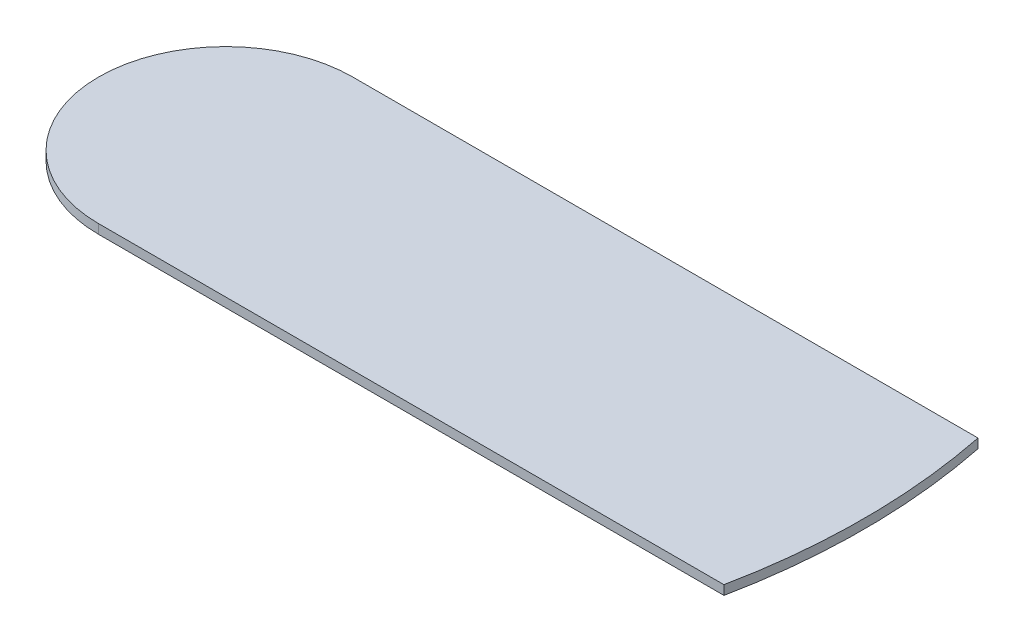
ISO-10303-21;
HEADER;
FILE_DESCRIPTION(('STEP AP214'),'2;1');
FILE_NAME('part.step','',(''),(''),'','','');
FILE_SCHEMA(('AUTOMOTIVE_DESIGN { 1 0 10303 214 1 1 1 1 }'));
ENDSEC;
DATA;
#1=APPLICATION_CONTEXT('core data for automotive mechanical design processes');
#2=APPLICATION_PROTOCOL_DEFINITION('international standard','automotive_design',2000,#1);
#3=PRODUCT_CONTEXT('',#1,'mechanical');
#4=PRODUCT('Part','Part','',(#3));
#5=PRODUCT_RELATED_PRODUCT_CATEGORY('part','',(#4));
#6=PRODUCT_DEFINITION_FORMATION('','',#4);
#7=PRODUCT_DEFINITION_CONTEXT('part definition',#1,'design');
#8=PRODUCT_DEFINITION('design','',#6,#7);
#9=PRODUCT_DEFINITION_SHAPE('','',#8);
#10=(LENGTH_UNIT() NAMED_UNIT(*) SI_UNIT(.MILLI.,.METRE.));
#11=(NAMED_UNIT(*) PLANE_ANGLE_UNIT() SI_UNIT($,.RADIAN.));
#12=(NAMED_UNIT(*) SI_UNIT($,.STERADIAN.) SOLID_ANGLE_UNIT());
#13=UNCERTAINTY_MEASURE_WITH_UNIT(LENGTH_MEASURE(1.E-05),#10,'distance_accuracy_value','');
#14=(GEOMETRIC_REPRESENTATION_CONTEXT(3) GLOBAL_UNCERTAINTY_ASSIGNED_CONTEXT((#13)) GLOBAL_UNIT_ASSIGNED_CONTEXT((#10,
#11,#12)) REPRESENTATION_CONTEXT('',''));
#15=CARTESIAN_POINT('',(0.,0.,0.));
#16=DIRECTION('',(0.,0.,1.));
#17=DIRECTION('',(1.,0.,0.));
#18=AXIS2_PLACEMENT_3D('',#15,#16,#17);
#19=CARTESIAN_POINT('',(0.,1.95,0.));
#20=DIRECTION('',(0.,-1.,0.));
#21=DIRECTION('',(0.,0.,-1.));
#22=AXIS2_PLACEMENT_3D('',#19,#20,#21);
#23=CYLINDRICAL_SURFACE('',#22,26.575);
#24=CARTESIAN_POINT('',(0.,0.,0.));
#25=DIRECTION('',(0.,1.,0.));
#26=DIRECTION('',(0.,0.,1.));
#27=AXIS2_PLACEMENT_3D('',#24,#25,#26);
#28=CIRCLE('',#27,26.575);
#29=CARTESIAN_POINT('',(0.,0.,-26.575));
#30=VERTEX_POINT('',#29);
#31=CARTESIAN_POINT('',(0.,0.,26.575));
#32=VERTEX_POINT('',#31);
#33=EDGE_CURVE('E95',#30,#32,#28,.T.);
#34=ORIENTED_EDGE('',*,*,#33,.T.);
#35=DIRECTION('',(0.,-1.,0.));
#36=VECTOR('',#35,1.);
#37=CARTESIAN_POINT('',(0.,1.95,26.575));
#38=LINE('',#37,#36);
#39=CARTESIAN_POINT('',(0.,1.95,26.575));
#40=VERTEX_POINT('',#39);
#41=EDGE_CURVE('E11',#40,#32,#38,.T.);
#42=ORIENTED_EDGE('',*,*,#41,.F.);
#43=CARTESIAN_POINT('',(0.,1.95,0.));
#44=DIRECTION('',(0.,1.,0.));
#45=DIRECTION('',(0.,0.,1.));
#46=AXIS2_PLACEMENT_3D('',#43,#44,#45);
#47=CIRCLE('',#46,26.575);
#48=CARTESIAN_POINT('',(0.,1.95,-26.575));
#49=VERTEX_POINT('',#48);
#50=EDGE_CURVE('E81',#49,#40,#47,.T.);
#51=ORIENTED_EDGE('',*,*,#50,.F.);
#52=DIRECTION('',(0.,-1.,0.));
#53=VECTOR('',#52,1.);
#54=CARTESIAN_POINT('',(0.,1.95,-26.575));
#55=LINE('',#54,#53);
#56=EDGE_CURVE('E48',#49,#30,#55,.T.);
#57=ORIENTED_EDGE('',*,*,#56,.T.);
#58=EDGE_LOOP('',(#34,#42,#51,#57));
#59=FACE_BOUND('',#58,.T.);
#60=ADVANCED_FACE('F32',(#59),#23,.T.);
#61=CARTESIAN_POINT('',(0.,1.95,26.575));
#62=DIRECTION('',(0.,0.,-1.));
#63=DIRECTION('',(-1.,0.,0.));
#64=AXIS2_PLACEMENT_3D('',#61,#62,#63);
#65=PLANE('',#64);
#66=DIRECTION('',(1.,0.,0.));
#67=VECTOR('',#66,1.);
#68=CARTESIAN_POINT('',(0.,0.,26.575));
#69=LINE('',#68,#67);
#70=CARTESIAN_POINT('',(130.828205578919,0.,26.575));
#71=VERTEX_POINT('',#70);
#72=EDGE_CURVE('E87',#32,#71,#69,.T.);
#73=ORIENTED_EDGE('',*,*,#72,.T.);
#74=DIRECTION('',(0.,-1.,0.));
#75=VECTOR('',#74,1.);
#76=CARTESIAN_POINT('',(130.828205578919,1.95,26.575));
#77=LINE('',#76,#75);
#78=CARTESIAN_POINT('',(130.828205578919,1.95,26.575));
#79=VERTEX_POINT('',#78);
#80=EDGE_CURVE('E40',#79,#71,#77,.T.);
#81=ORIENTED_EDGE('',*,*,#80,.F.);
#82=DIRECTION('',(1.,0.,0.));
#83=VECTOR('',#82,1.);
#84=CARTESIAN_POINT('',(0.,1.95,26.575));
#85=LINE('',#84,#83);
#86=EDGE_CURVE('E74',#40,#79,#85,.T.);
#87=ORIENTED_EDGE('',*,*,#86,.F.);
#88=ORIENTED_EDGE('',*,*,#41,.T.);
#89=EDGE_LOOP('',(#73,#81,#87,#88));
#90=FACE_BOUND('',#89,.T.);
#91=ADVANCED_FACE('F86',(#90),#65,.F.);
#92=CARTESIAN_POINT('',(0.,1.95,0.));
#93=DIRECTION('',(0.,-1.,0.));
#94=DIRECTION('',(0.,0.,-1.));
#95=AXIS2_PLACEMENT_3D('',#92,#93,#94);
#96=CYLINDRICAL_SURFACE('',#95,133.5);
#97=CARTESIAN_POINT('',(0.,0.,0.));
#98=DIRECTION('',(0.,1.,0.));
#99=DIRECTION('',(0.,0.,1.));
#100=AXIS2_PLACEMENT_3D('',#97,#98,#99);
#101=CIRCLE('',#100,133.5);
#102=CARTESIAN_POINT('',(130.828205578919,0.,-26.575));
#103=VERTEX_POINT('',#102);
#104=EDGE_CURVE('E98',#71,#103,#101,.T.);
#105=ORIENTED_EDGE('',*,*,#104,.T.);
#106=DIRECTION('',(0.,-1.,0.));
#107=VECTOR('',#106,1.);
#108=CARTESIAN_POINT('',(130.828205578919,1.95,-26.575));
#109=LINE('',#108,#107);
#110=CARTESIAN_POINT('',(130.828205578919,1.95,-26.575));
#111=VERTEX_POINT('',#110);
#112=EDGE_CURVE('E63',#111,#103,#109,.T.);
#113=ORIENTED_EDGE('',*,*,#112,.F.);
#114=CARTESIAN_POINT('',(0.,1.95,0.));
#115=DIRECTION('',(0.,-1.,0.));
#116=DIRECTION('',(0.,0.,-1.));
#117=AXIS2_PLACEMENT_3D('',#114,#115,#116);
#118=CIRCLE('',#117,133.5);
#119=EDGE_CURVE('E80',#111,#79,#118,.T.);
#120=ORIENTED_EDGE('',*,*,#119,.T.);
#121=ORIENTED_EDGE('',*,*,#80,.T.);
#122=EDGE_LOOP('',(#105,#113,#120,#121));
#123=FACE_BOUND('',#122,.T.);
#124=ADVANCED_FACE('F89',(#123),#96,.T.);
#125=CARTESIAN_POINT('',(0.,1.95,-26.575));
#126=DIRECTION('',(0.,0.,-1.));
#127=DIRECTION('',(-1.,0.,0.));
#128=AXIS2_PLACEMENT_3D('',#125,#126,#127);
#129=PLANE('',#128);
#130=DIRECTION('',(1.,0.,0.));
#131=VECTOR('',#130,1.);
#132=CARTESIAN_POINT('',(0.,0.,-26.575));
#133=LINE('',#132,#131);
#134=EDGE_CURVE('E100',#30,#103,#133,.T.);
#135=ORIENTED_EDGE('',*,*,#134,.F.);
#136=ORIENTED_EDGE('',*,*,#56,.F.);
#137=DIRECTION('',(1.,0.,0.));
#138=VECTOR('',#137,1.);
#139=CARTESIAN_POINT('',(0.,1.95,-26.575));
#140=LINE('',#139,#138);
#141=EDGE_CURVE('E90',#49,#111,#140,.T.);
#142=ORIENTED_EDGE('',*,*,#141,.T.);
#143=ORIENTED_EDGE('',*,*,#112,.T.);
#144=EDGE_LOOP('',(#135,#136,#142,#143));
#145=FACE_BOUND('',#144,.T.);
#146=ADVANCED_FACE('F106',(#145),#129,.T.);
#147=CARTESIAN_POINT('',(0.,1.95,0.));
#148=DIRECTION('',(0.,1.,0.));
#149=DIRECTION('',(0.,0.,1.));
#150=AXIS2_PLACEMENT_3D('',#147,#148,#149);
#151=PLANE('',#150);
#152=ORIENTED_EDGE('',*,*,#50,.T.);
#153=ORIENTED_EDGE('',*,*,#86,.T.);
#154=ORIENTED_EDGE('',*,*,#119,.F.);
#155=ORIENTED_EDGE('',*,*,#141,.F.);
#156=EDGE_LOOP('',(#152,#153,#154,#155));
#157=FACE_BOUND('',#156,.T.);
#158=ADVANCED_FACE('F77',(#157),#151,.T.);
#159=CARTESIAN_POINT('',(0.,0.,0.));
#160=DIRECTION('',(0.,1.,0.));
#161=DIRECTION('',(0.,0.,1.));
#162=AXIS2_PLACEMENT_3D('',#159,#160,#161);
#163=PLANE('',#162);
#164=ORIENTED_EDGE('',*,*,#33,.F.);
#165=ORIENTED_EDGE('',*,*,#134,.T.);
#166=ORIENTED_EDGE('',*,*,#104,.F.);
#167=ORIENTED_EDGE('',*,*,#72,.F.);
#168=EDGE_LOOP('',(#164,#165,#166,#167));
#169=FACE_BOUND('',#168,.T.);
#170=ADVANCED_FACE('F105',(#169),#163,.F.);
#171=CLOSED_SHELL('',(#60,#91,#124,#146,#158,#170));
#172=MANIFOLD_SOLID_BREP('B2',#171);
#173=ADVANCED_BREP_SHAPE_REPRESENTATION('',(#18,#172),#14);
#174=SHAPE_DEFINITION_REPRESENTATION(#9,#173);
ENDSEC;
END-ISO-10303-21;
